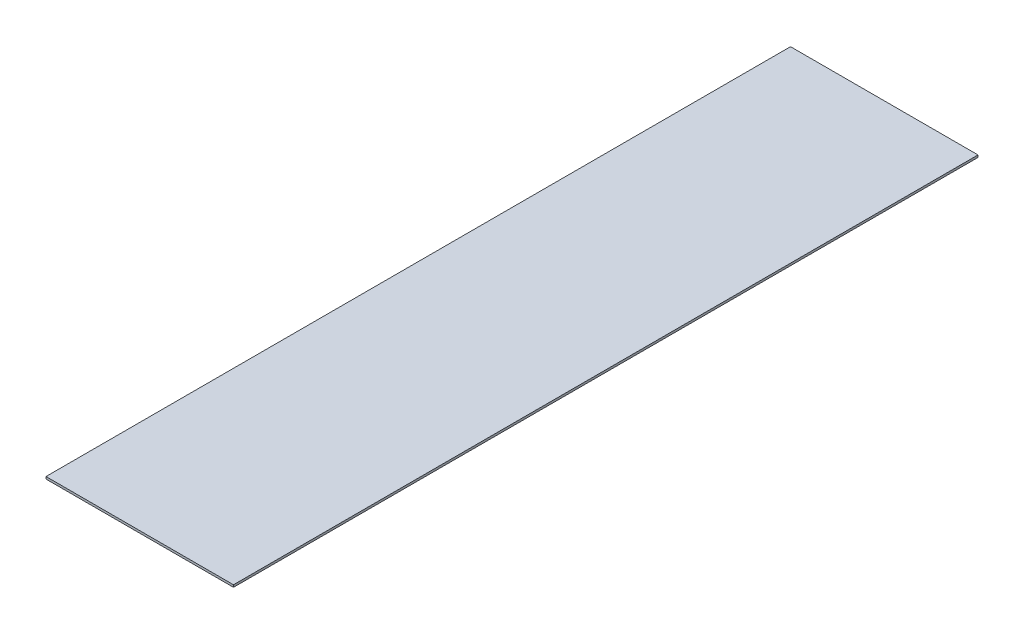
ISO-10303-21;
HEADER;
FILE_DESCRIPTION(('STEP AP214'),'2;1');
FILE_NAME('part.step','',(''),(''),'','','');
FILE_SCHEMA(('AUTOMOTIVE_DESIGN { 1 0 10303 214 1 1 1 1 }'));
ENDSEC;
DATA;
#1=APPLICATION_CONTEXT('core data for automotive mechanical design processes');
#2=APPLICATION_PROTOCOL_DEFINITION('international standard','automotive_design',2000,#1);
#3=PRODUCT_CONTEXT('',#1,'mechanical');
#4=PRODUCT('Part','Part','',(#3));
#5=PRODUCT_RELATED_PRODUCT_CATEGORY('part','',(#4));
#6=PRODUCT_DEFINITION_FORMATION('','',#4);
#7=PRODUCT_DEFINITION_CONTEXT('part definition',#1,'design');
#8=PRODUCT_DEFINITION('design','',#6,#7);
#9=PRODUCT_DEFINITION_SHAPE('','',#8);
#10=(LENGTH_UNIT() NAMED_UNIT(*) SI_UNIT(.MILLI.,.METRE.));
#11=(NAMED_UNIT(*) PLANE_ANGLE_UNIT() SI_UNIT($,.RADIAN.));
#12=(NAMED_UNIT(*) SI_UNIT($,.STERADIAN.) SOLID_ANGLE_UNIT());
#13=UNCERTAINTY_MEASURE_WITH_UNIT(LENGTH_MEASURE(1.E-05),#10,'distance_accuracy_value','');
#14=(GEOMETRIC_REPRESENTATION_CONTEXT(3) GLOBAL_UNCERTAINTY_ASSIGNED_CONTEXT((#13)) GLOBAL_UNIT_ASSIGNED_CONTEXT((#10,
#11,#12)) REPRESENTATION_CONTEXT('',''));
#15=CARTESIAN_POINT('',(0.,0.,0.));
#16=DIRECTION('',(0.,0.,1.));
#17=DIRECTION('',(1.,0.,0.));
#18=AXIS2_PLACEMENT_3D('',#15,#16,#17);
#19=CARTESIAN_POINT('',(-2097.06000099711,-50.,2727.52225433638));
#20=DIRECTION('',(-1.,0.,0.));
#21=DIRECTION('',(0.,0.,1.));
#22=AXIS2_PLACEMENT_3D('',#19,#20,#21);
#23=PLANE('',#22);
#24=DIRECTION('',(0.,0.,1.));
#25=VECTOR('',#24,1.);
#26=CARTESIAN_POINT('',(-2097.06000099711,0.,2727.52225433638));
#27=LINE('',#26,#25);
#28=CARTESIAN_POINT('',(-2097.06000099711,0.,-13927.3312302475));
#29=VERTEX_POINT('',#28);
#30=CARTESIAN_POINT('',(-2097.06000099711,0.,2727.52225433638));
#31=VERTEX_POINT('',#30);
#32=EDGE_CURVE('E108',#29,#31,#27,.T.);
#33=ORIENTED_EDGE('',*,*,#32,.F.);
#34=DIRECTION('',(0.,1.,0.));
#35=VECTOR('',#34,1.);
#36=CARTESIAN_POINT('',(-2097.06000099711,-50.,-13927.3312302475));
#37=LINE('',#36,#35);
#38=CARTESIAN_POINT('',(-2097.06000099711,-50.,-13927.3312302475));
#39=VERTEX_POINT('',#38);
#40=EDGE_CURVE('E11',#39,#29,#37,.T.);
#41=ORIENTED_EDGE('',*,*,#40,.F.);
#42=DIRECTION('',(0.,0.,1.));
#43=VECTOR('',#42,1.);
#44=CARTESIAN_POINT('',(-2097.06000099711,-50.,2727.52225433638));
#45=LINE('',#44,#43);
#46=CARTESIAN_POINT('',(-2097.06000099711,-50.,2727.52225433638));
#47=VERTEX_POINT('',#46);
#48=EDGE_CURVE('E99',#39,#47,#45,.T.);
#49=ORIENTED_EDGE('',*,*,#48,.T.);
#50=DIRECTION('',(0.,1.,0.));
#51=VECTOR('',#50,1.);
#52=CARTESIAN_POINT('',(-2097.06000099711,-50.,2727.52225433638));
#53=LINE('',#52,#51);
#54=EDGE_CURVE('E43',#47,#31,#53,.T.);
#55=ORIENTED_EDGE('',*,*,#54,.T.);
#56=EDGE_LOOP('',(#33,#41,#49,#55));
#57=FACE_BOUND('',#56,.T.);
#58=ADVANCED_FACE('F40',(#57),#23,.T.);
#59=CARTESIAN_POINT('',(-2097.06000099711,-50.,-13927.3312302475));
#60=DIRECTION('',(0.,0.,-1.));
#61=DIRECTION('',(-1.,0.,0.));
#62=AXIS2_PLACEMENT_3D('',#59,#60,#61);
#63=PLANE('',#62);
#64=DIRECTION('',(-1.,0.,0.));
#65=VECTOR('',#64,1.);
#66=CARTESIAN_POINT('',(-2097.06000099711,0.,-13927.3312302475));
#67=LINE('',#66,#65);
#68=CARTESIAN_POINT('',(2097.06000099715,0.,-13927.3312302475));
#69=VERTEX_POINT('',#68);
#70=EDGE_CURVE('E104',#69,#29,#67,.T.);
#71=ORIENTED_EDGE('',*,*,#70,.F.);
#72=DIRECTION('',(0.,1.,0.));
#73=VECTOR('',#72,1.);
#74=CARTESIAN_POINT('',(2097.06000099715,-50.,-13927.3312302475));
#75=LINE('',#74,#73);
#76=CARTESIAN_POINT('',(2097.06000099715,-50.,-13927.3312302475));
#77=VERTEX_POINT('',#76);
#78=EDGE_CURVE('E49',#77,#69,#75,.T.);
#79=ORIENTED_EDGE('',*,*,#78,.F.);
#80=DIRECTION('',(-1.,0.,0.));
#81=VECTOR('',#80,1.);
#82=CARTESIAN_POINT('',(-2097.06000099711,-50.,-13927.3312302475));
#83=LINE('',#82,#81);
#84=EDGE_CURVE('E95',#77,#39,#83,.T.);
#85=ORIENTED_EDGE('',*,*,#84,.T.);
#86=ORIENTED_EDGE('',*,*,#40,.T.);
#87=EDGE_LOOP('',(#71,#79,#85,#86));
#88=FACE_BOUND('',#87,.T.);
#89=ADVANCED_FACE('F118',(#88),#63,.T.);
#90=CARTESIAN_POINT('',(2097.06000099715,-50.,2727.52225433638));
#91=DIRECTION('',(1.,0.,0.));
#92=DIRECTION('',(0.,0.,-1.));
#93=AXIS2_PLACEMENT_3D('',#90,#91,#92);
#94=PLANE('',#93);
#95=DIRECTION('',(0.,0.,-1.));
#96=VECTOR('',#95,1.);
#97=CARTESIAN_POINT('',(2097.06000099715,0.,2727.52225433638));
#98=LINE('',#97,#96);
#99=CARTESIAN_POINT('',(2097.06000099715,0.,2727.52225433638));
#100=VERTEX_POINT('',#99);
#101=EDGE_CURVE('E90',#100,#69,#98,.T.);
#102=ORIENTED_EDGE('',*,*,#101,.F.);
#103=DIRECTION('',(0.,1.,0.));
#104=VECTOR('',#103,1.);
#105=CARTESIAN_POINT('',(2097.06000099715,-50.,2727.52225433638));
#106=LINE('',#105,#104);
#107=CARTESIAN_POINT('',(2097.06000099715,-50.,2727.52225433638));
#108=VERTEX_POINT('',#107);
#109=EDGE_CURVE('E85',#108,#100,#106,.T.);
#110=ORIENTED_EDGE('',*,*,#109,.F.);
#111=DIRECTION('',(0.,0.,-1.));
#112=VECTOR('',#111,1.);
#113=CARTESIAN_POINT('',(2097.06000099715,-50.,2727.52225433638));
#114=LINE('',#113,#112);
#115=EDGE_CURVE('E88',#108,#77,#114,.T.);
#116=ORIENTED_EDGE('',*,*,#115,.T.);
#117=ORIENTED_EDGE('',*,*,#78,.T.);
#118=EDGE_LOOP('',(#102,#110,#116,#117));
#119=FACE_BOUND('',#118,.T.);
#120=ADVANCED_FACE('F87',(#119),#94,.T.);
#121=CARTESIAN_POINT('',(-2097.06000099711,-50.,2727.52225433638));
#122=DIRECTION('',(0.,0.,1.));
#123=DIRECTION('',(1.,0.,0.));
#124=AXIS2_PLACEMENT_3D('',#121,#122,#123);
#125=PLANE('',#124);
#126=DIRECTION('',(1.,0.,0.));
#127=VECTOR('',#126,1.);
#128=CARTESIAN_POINT('',(-2097.06000099711,0.,2727.52225433638));
#129=LINE('',#128,#127);
#130=EDGE_CURVE('E111',#31,#100,#129,.T.);
#131=ORIENTED_EDGE('',*,*,#130,.F.);
#132=ORIENTED_EDGE('',*,*,#54,.F.);
#133=DIRECTION('',(1.,0.,0.));
#134=VECTOR('',#133,1.);
#135=CARTESIAN_POINT('',(-2097.06000099711,-50.,2727.52225433638));
#136=LINE('',#135,#134);
#137=EDGE_CURVE('E94',#47,#108,#136,.T.);
#138=ORIENTED_EDGE('',*,*,#137,.T.);
#139=ORIENTED_EDGE('',*,*,#109,.T.);
#140=EDGE_LOOP('',(#131,#132,#138,#139));
#141=FACE_BOUND('',#140,.T.);
#142=ADVANCED_FACE('F97',(#141),#125,.T.);
#143=CARTESIAN_POINT('',(0.,-50.,0.));
#144=DIRECTION('',(0.,-1.,0.));
#145=DIRECTION('',(0.,0.,-1.));
#146=AXIS2_PLACEMENT_3D('',#143,#144,#145);
#147=PLANE('',#146);
#148=ORIENTED_EDGE('',*,*,#48,.F.);
#149=ORIENTED_EDGE('',*,*,#84,.F.);
#150=ORIENTED_EDGE('',*,*,#115,.F.);
#151=ORIENTED_EDGE('',*,*,#137,.F.);
#152=EDGE_LOOP('',(#148,#149,#150,#151));
#153=FACE_BOUND('',#152,.T.);
#154=ADVANCED_FACE('F93',(#153),#147,.T.);
#155=CARTESIAN_POINT('',(0.,0.,0.));
#156=DIRECTION('',(0.,-1.,0.));
#157=DIRECTION('',(0.,0.,-1.));
#158=AXIS2_PLACEMENT_3D('',#155,#156,#157);
#159=PLANE('',#158);
#160=ORIENTED_EDGE('',*,*,#32,.T.);
#161=ORIENTED_EDGE('',*,*,#130,.T.);
#162=ORIENTED_EDGE('',*,*,#101,.T.);
#163=ORIENTED_EDGE('',*,*,#70,.T.);
#164=EDGE_LOOP('',(#160,#161,#162,#163));
#165=FACE_BOUND('',#164,.T.);
#166=ADVANCED_FACE('F117',(#165),#159,.F.);
#167=CLOSED_SHELL('',(#58,#89,#120,#142,#154,#166));
#168=MANIFOLD_SOLID_BREP('B2',#167);
#169=ADVANCED_BREP_SHAPE_REPRESENTATION('',(#18,#168),#14);
#170=SHAPE_DEFINITION_REPRESENTATION(#9,#169);
ENDSEC;
END-ISO-10303-21;
